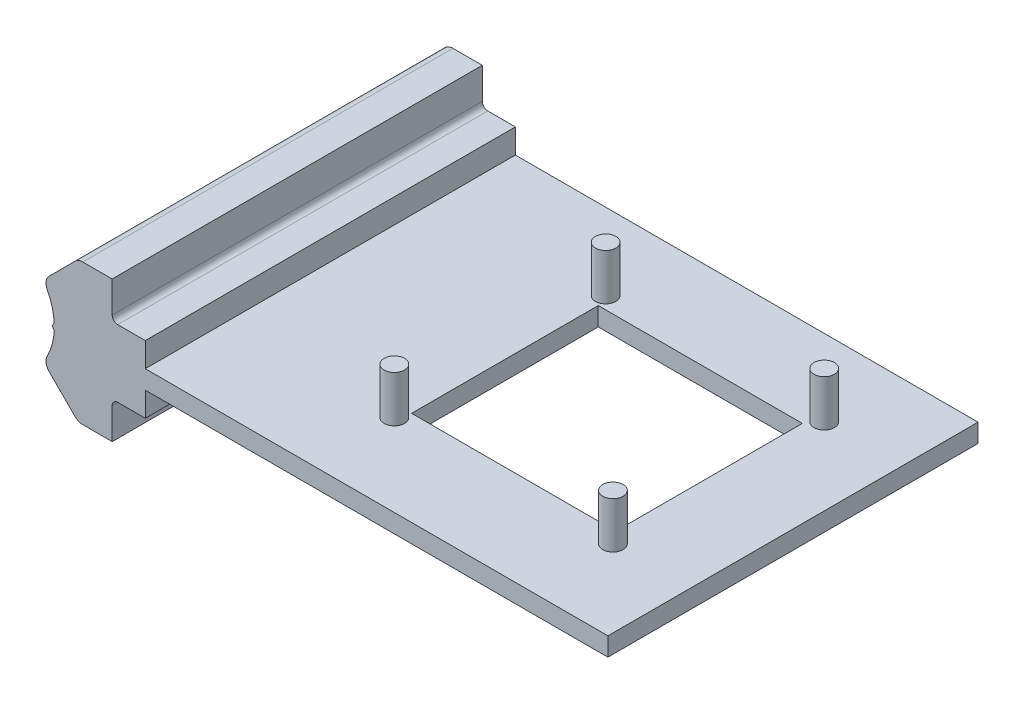
ISO-10303-21;
HEADER;
FILE_DESCRIPTION(('STEP AP214'),'2;1');
FILE_NAME('part.step','',(''),(''),'','','');
FILE_SCHEMA(('AUTOMOTIVE_DESIGN { 1 0 10303 214 1 1 1 1 }'));
ENDSEC;
DATA;
#1=APPLICATION_CONTEXT('core data for automotive mechanical design processes');
#2=APPLICATION_PROTOCOL_DEFINITION('international standard','automotive_design',2000,#1);
#3=PRODUCT_CONTEXT('',#1,'mechanical');
#4=PRODUCT('Part','Part','',(#3));
#5=PRODUCT_RELATED_PRODUCT_CATEGORY('part','',(#4));
#6=PRODUCT_DEFINITION_FORMATION('','',#4);
#7=PRODUCT_DEFINITION_CONTEXT('part definition',#1,'design');
#8=PRODUCT_DEFINITION('design','',#6,#7);
#9=PRODUCT_DEFINITION_SHAPE('','',#8);
#10=(LENGTH_UNIT() NAMED_UNIT(*) SI_UNIT(.MILLI.,.METRE.));
#11=(NAMED_UNIT(*) PLANE_ANGLE_UNIT() SI_UNIT($,.RADIAN.));
#12=(NAMED_UNIT(*) SI_UNIT($,.STERADIAN.) SOLID_ANGLE_UNIT());
#13=UNCERTAINTY_MEASURE_WITH_UNIT(LENGTH_MEASURE(1.E-05),#10,'distance_accuracy_value','');
#14=(GEOMETRIC_REPRESENTATION_CONTEXT(3) GLOBAL_UNCERTAINTY_ASSIGNED_CONTEXT((#13)) GLOBAL_UNIT_ASSIGNED_CONTEXT((#10,
#11,#12)) REPRESENTATION_CONTEXT('',''));
#15=CARTESIAN_POINT('',(0.,0.,0.));
#16=DIRECTION('',(0.,0.,1.));
#17=DIRECTION('',(1.,0.,0.));
#18=AXIS2_PLACEMENT_3D('',#15,#16,#17);
#19=CARTESIAN_POINT('',(42.5097065168337,15.9553416596242,387.558905075487));
#20=DIRECTION('',(0.,1.,0.));
#21=DIRECTION('',(0.,0.,1.));
#22=AXIS2_PLACEMENT_3D('',#19,#20,#21);
#23=PLANE('',#22);
#24=DIRECTION('',(0.,0.,1.));
#25=VECTOR('',#24,1.);
#26=CARTESIAN_POINT('',(66.0868749176624,15.9553416596242,399.7634213984));
#27=LINE('',#26,#25);
#28=CARTESIAN_POINT('',(66.0868749176624,15.9553416596242,399.7634213984));
#29=VERTEX_POINT('',#28);
#30=CARTESIAN_POINT('',(66.0868749176624,15.9553416596242,425.3814213984));
#31=VERTEX_POINT('',#30);
#32=EDGE_CURVE('E58',#29,#31,#27,.T.);
#33=ORIENTED_EDGE('',*,*,#32,.F.);
#34=DIRECTION('',(-1.,0.,0.));
#35=VECTOR('',#34,1.);
#36=CARTESIAN_POINT('',(66.0868749176624,15.9553416596242,399.7634213984));
#37=LINE('',#36,#35);
#38=CARTESIAN_POINT('',(94.1018749176624,15.9553416596242,399.7634213984));
#39=VERTEX_POINT('',#38);
#40=EDGE_CURVE('E241',#39,#29,#37,.T.);
#41=ORIENTED_EDGE('',*,*,#40,.F.);
#42=DIRECTION('',(0.,0.,-1.));
#43=VECTOR('',#42,1.);
#44=CARTESIAN_POINT('',(94.1018749176624,15.9553416596242,399.7634213984));
#45=LINE('',#44,#43);
#46=CARTESIAN_POINT('',(94.1018749176624,15.9553416596242,425.3814213984));
#47=VERTEX_POINT('',#46);
#48=EDGE_CURVE('E224',#47,#39,#45,.T.);
#49=ORIENTED_EDGE('',*,*,#48,.F.);
#50=DIRECTION('',(1.,0.,0.));
#51=VECTOR('',#50,1.);
#52=CARTESIAN_POINT('',(66.0868749176624,15.9553416596242,425.3814213984));
#53=LINE('',#52,#51);
#54=EDGE_CURVE('E234',#31,#47,#53,.T.);
#55=ORIENTED_EDGE('',*,*,#54,.F.);
#56=EDGE_LOOP('',(#33,#41,#49,#55));
#57=FACE_BOUND('',#56,.T.);
#58=CARTESIAN_POINT('',(65.4118749176624,15.9553416596242,427.0724213984));
#59=DIRECTION('',(0.,1.,0.));
#60=DIRECTION('',(0.,0.,1.));
#61=AXIS2_PLACEMENT_3D('',#58,#59,#60);
#62=CIRCLE('',#61,1.39699999999996);
#63=CARTESIAN_POINT('',(65.4118749176624,15.9553416596242,428.4694213984));
#64=VERTEX_POINT('',#63);
#65=EDGE_CURVE('E256',#64,#64,#62,.T.);
#66=ORIENTED_EDGE('',*,*,#65,.F.);
#67=EDGE_LOOP('',(#66));
#68=FACE_BOUND('',#67,.T.);
#69=CARTESIAN_POINT('',(95.4118749176624,15.9553416596242,427.0724213984));
#70=DIRECTION('',(0.,1.,0.));
#71=DIRECTION('',(0.,0.,1.));
#72=AXIS2_PLACEMENT_3D('',#69,#70,#71);
#73=CIRCLE('',#72,1.39699999999996);
#74=CARTESIAN_POINT('',(95.4118749176624,15.9553416596242,428.4694213984));
#75=VERTEX_POINT('',#74);
#76=EDGE_CURVE('E264',#75,#75,#73,.T.);
#77=ORIENTED_EDGE('',*,*,#76,.F.);
#78=EDGE_LOOP('',(#77));
#79=FACE_BOUND('',#78,.T.);
#80=CARTESIAN_POINT('',(95.4118749176624,15.9553416596242,398.0724213984));
#81=DIRECTION('',(0.,1.,0.));
#82=DIRECTION('',(0.,0.,1.));
#83=AXIS2_PLACEMENT_3D('',#80,#81,#82);
#84=CIRCLE('',#83,1.39699999999996);
#85=CARTESIAN_POINT('',(95.4118749176624,15.9553416596242,399.4694213984));
#86=VERTEX_POINT('',#85);
#87=EDGE_CURVE('E272',#86,#86,#84,.T.);
#88=ORIENTED_EDGE('',*,*,#87,.F.);
#89=EDGE_LOOP('',(#88));
#90=FACE_BOUND('',#89,.T.);
#91=CARTESIAN_POINT('',(65.4118749176624,15.9553416596242,398.0724213984));
#92=DIRECTION('',(0.,1.,0.));
#93=DIRECTION('',(0.,0.,1.));
#94=AXIS2_PLACEMENT_3D('',#91,#92,#93);
#95=CIRCLE('',#94,1.39699999999996);
#96=CARTESIAN_POINT('',(65.4118749176624,15.9553416596242,399.4694213984));
#97=VERTEX_POINT('',#96);
#98=EDGE_CURVE('E276',#97,#97,#95,.T.);
#99=ORIENTED_EDGE('',*,*,#98,.F.);
#100=EDGE_LOOP('',(#99));
#101=FACE_BOUND('',#100,.T.);
#102=DIRECTION('',(-1.,0.,0.));
#103=VECTOR('',#102,1.);
#104=CARTESIAN_POINT('',(42.5097065168337,15.9553416596242,438.358905075487));
#105=LINE('',#104,#103);
#106=CARTESIAN_POINT('',(106.009706516834,15.9553416596242,438.358905075487));
#107=VERTEX_POINT('',#106);
#108=CARTESIAN_POINT('',(42.5097065168337,15.9553416596242,438.358905075487));
#109=VERTEX_POINT('',#108);
#110=EDGE_CURVE('E284',#107,#109,#105,.T.);
#111=ORIENTED_EDGE('',*,*,#110,.F.);
#112=DIRECTION('',(0.,0.,1.));
#113=VECTOR('',#112,1.);
#114=CARTESIAN_POINT('',(106.009706516834,15.9553416596242,387.558905075487));
#115=LINE('',#114,#113);
#116=CARTESIAN_POINT('',(106.009706516834,15.9553416596242,387.558905075487));
#117=VERTEX_POINT('',#116);
#118=EDGE_CURVE('E472',#117,#107,#115,.T.);
#119=ORIENTED_EDGE('',*,*,#118,.F.);
#120=DIRECTION('',(-1.,0.,0.));
#121=VECTOR('',#120,1.);
#122=CARTESIAN_POINT('',(42.5097065168337,15.9553416596242,387.558905075487));
#123=LINE('',#122,#121);
#124=CARTESIAN_POINT('',(42.5097065168337,15.9553416596242,387.558905075487));
#125=VERTEX_POINT('',#124);
#126=EDGE_CURVE('E288',#117,#125,#123,.T.);
#127=ORIENTED_EDGE('',*,*,#126,.T.);
#128=DIRECTION('',(0.,0.,1.));
#129=VECTOR('',#128,1.);
#130=CARTESIAN_POINT('',(42.5097065168337,15.9553416596242,387.558905075487));
#131=LINE('',#130,#129);
#132=EDGE_CURVE('E381',#125,#109,#131,.T.);
#133=ORIENTED_EDGE('',*,*,#132,.T.);
#134=EDGE_LOOP('',(#111,#119,#127,#133));
#135=FACE_BOUND('',#134,.T.);
#136=ADVANCED_FACE('F43',(#57,#68,#79,#90,#101,#135),#23,.T.);
#137=CARTESIAN_POINT('',(106.009706516834,15.9553416596242,387.558905075487));
#138=DIRECTION('',(1.,0.,0.));
#139=DIRECTION('',(0.,0.,-1.));
#140=AXIS2_PLACEMENT_3D('',#137,#138,#139);
#141=PLANE('',#140);
#142=DIRECTION('',(0.,1.,0.));
#143=VECTOR('',#142,1.);
#144=CARTESIAN_POINT('',(106.009706516834,15.9553416596242,438.358905075487));
#145=LINE('',#144,#143);
#146=CARTESIAN_POINT('',(106.009706516834,13.4153416596242,438.358905075487));
#147=VERTEX_POINT('',#146);
#148=EDGE_CURVE('E293',#147,#107,#145,.T.);
#149=ORIENTED_EDGE('',*,*,#148,.F.);
#150=DIRECTION('',(0.,0.,1.));
#151=VECTOR('',#150,1.);
#152=CARTESIAN_POINT('',(106.009706516834,13.4153416596242,387.558905075487));
#153=LINE('',#152,#151);
#154=CARTESIAN_POINT('',(106.009706516834,13.4153416596242,387.558905075487));
#155=VERTEX_POINT('',#154);
#156=EDGE_CURVE('E476',#155,#147,#153,.T.);
#157=ORIENTED_EDGE('',*,*,#156,.F.);
#158=DIRECTION('',(0.,1.,0.));
#159=VECTOR('',#158,1.);
#160=CARTESIAN_POINT('',(106.009706516834,15.9553416596242,387.558905075487));
#161=LINE('',#160,#159);
#162=EDGE_CURVE('E377',#155,#117,#161,.T.);
#163=ORIENTED_EDGE('',*,*,#162,.T.);
#164=ORIENTED_EDGE('',*,*,#118,.T.);
#165=EDGE_LOOP('',(#149,#157,#163,#164));
#166=FACE_BOUND('',#165,.T.);
#167=ADVANCED_FACE('F569',(#166),#141,.T.);
#168=CARTESIAN_POINT('',(106.009706516834,13.4153416596242,387.558905075487));
#169=DIRECTION('',(0.,-1.,0.));
#170=DIRECTION('',(0.,0.,-1.));
#171=AXIS2_PLACEMENT_3D('',#168,#169,#170);
#172=PLANE('',#171);
#173=DIRECTION('',(0.,0.,-1.));
#174=VECTOR('',#173,1.);
#175=CARTESIAN_POINT('',(66.0868749176624,13.4153416596242,387.558905075487));
#176=LINE('',#175,#174);
#177=CARTESIAN_POINT('',(66.0868749176624,13.4153416596242,425.3814213984));
#178=VERTEX_POINT('',#177);
#179=CARTESIAN_POINT('',(66.0868749176624,13.4153416596242,399.7634213984));
#180=VERTEX_POINT('',#179);
#181=EDGE_CURVE('E11',#178,#180,#176,.T.);
#182=ORIENTED_EDGE('',*,*,#181,.F.);
#183=DIRECTION('',(-1.,0.,0.));
#184=VECTOR('',#183,1.);
#185=CARTESIAN_POINT('',(106.009706516834,13.4153416596242,425.3814213984));
#186=LINE('',#185,#184);
#187=CARTESIAN_POINT('',(94.1018749176624,13.4153416596242,425.3814213984));
#188=VERTEX_POINT('',#187);
#189=EDGE_CURVE('E475',#188,#178,#186,.T.);
#190=ORIENTED_EDGE('',*,*,#189,.F.);
#191=DIRECTION('',(0.,0.,1.));
#192=VECTOR('',#191,1.);
#193=CARTESIAN_POINT('',(94.1018749176624,13.4153416596242,387.558905075487));
#194=LINE('',#193,#192);
#195=CARTESIAN_POINT('',(94.1018749176624,13.4153416596242,399.7634213984));
#196=VERTEX_POINT('',#195);
#197=EDGE_CURVE('E227',#196,#188,#194,.T.);
#198=ORIENTED_EDGE('',*,*,#197,.F.);
#199=DIRECTION('',(1.,0.,0.));
#200=VECTOR('',#199,1.);
#201=CARTESIAN_POINT('',(106.009706516834,13.4153416596242,399.7634213984));
#202=LINE('',#201,#200);
#203=EDGE_CURVE('E51',#180,#196,#202,.T.);
#204=ORIENTED_EDGE('',*,*,#203,.F.);
#205=EDGE_LOOP('',(#182,#190,#198,#204));
#206=FACE_BOUND('',#205,.T.);
#207=DIRECTION('',(1.,0.,0.));
#208=VECTOR('',#207,1.);
#209=CARTESIAN_POINT('',(106.009706516834,13.4153416596242,438.358905075487));
#210=LINE('',#209,#208);
#211=CARTESIAN_POINT('',(42.5097065168337,13.4153416596242,438.358905075487));
#212=VERTEX_POINT('',#211);
#213=EDGE_CURVE('E465',#212,#147,#210,.T.);
#214=ORIENTED_EDGE('',*,*,#213,.F.);
#215=DIRECTION('',(0.,0.,1.));
#216=VECTOR('',#215,1.);
#217=CARTESIAN_POINT('',(42.5097065168337,13.4153416596242,387.558905075487));
#218=LINE('',#217,#216);
#219=CARTESIAN_POINT('',(42.5097065168337,13.4153416596242,387.558905075487));
#220=VERTEX_POINT('',#219);
#221=EDGE_CURVE('E479',#220,#212,#218,.T.);
#222=ORIENTED_EDGE('',*,*,#221,.F.);
#223=DIRECTION('',(1.,0.,0.));
#224=VECTOR('',#223,1.);
#225=CARTESIAN_POINT('',(106.009706516834,13.4153416596242,387.558905075487));
#226=LINE('',#225,#224);
#227=EDGE_CURVE('E373',#220,#155,#226,.T.);
#228=ORIENTED_EDGE('',*,*,#227,.T.);
#229=ORIENTED_EDGE('',*,*,#156,.T.);
#230=EDGE_LOOP('',(#214,#222,#228,#229));
#231=FACE_BOUND('',#230,.T.);
#232=ADVANCED_FACE('F551',(#206,#231),#172,.T.);
#233=CARTESIAN_POINT('',(42.5097065168337,13.4153416596242,387.558905075487));
#234=DIRECTION('',(1.,0.,0.));
#235=DIRECTION('',(0.,1.,0.));
#236=AXIS2_PLACEMENT_3D('',#233,#234,#235);
#237=PLANE('',#236);
#238=DIRECTION('',(0.,1.,0.));
#239=VECTOR('',#238,1.);
#240=CARTESIAN_POINT('',(42.5097065168337,13.4153416596242,438.358905075487));
#241=LINE('',#240,#239);
#242=CARTESIAN_POINT('',(42.5097065168337,10.0663416596244,438.358905075487));
#243=VERTEX_POINT('',#242);
#244=EDGE_CURVE('E461',#243,#212,#241,.T.);
#245=ORIENTED_EDGE('',*,*,#244,.F.);
#246=DIRECTION('',(0.,0.,1.));
#247=VECTOR('',#246,1.);
#248=CARTESIAN_POINT('',(42.5097065168337,10.0663416596244,387.558905075487));
#249=LINE('',#248,#247);
#250=CARTESIAN_POINT('',(42.5097065168337,10.0663416596244,387.558905075487));
#251=VERTEX_POINT('',#250);
#252=EDGE_CURVE('E482',#251,#243,#249,.T.);
#253=ORIENTED_EDGE('',*,*,#252,.F.);
#254=DIRECTION('',(0.,1.,0.));
#255=VECTOR('',#254,1.);
#256=CARTESIAN_POINT('',(42.5097065168337,13.4153416596242,387.558905075487));
#257=LINE('',#256,#255);
#258=EDGE_CURVE('E369',#251,#220,#257,.T.);
#259=ORIENTED_EDGE('',*,*,#258,.T.);
#260=ORIENTED_EDGE('',*,*,#221,.T.);
#261=EDGE_LOOP('',(#245,#253,#259,#260));
#262=FACE_BOUND('',#261,.T.);
#263=ADVANCED_FACE('F578',(#262),#237,.T.);
#264=CARTESIAN_POINT('',(38.7252065168337,10.0663416596244,387.558905075487));
#265=DIRECTION('',(0.,-1.,0.));
#266=DIRECTION('',(1.,0.,0.));
#267=AXIS2_PLACEMENT_3D('',#264,#265,#266);
#268=PLANE('',#267);
#269=DIRECTION('',(1.,0.,0.));
#270=VECTOR('',#269,1.);
#271=CARTESIAN_POINT('',(38.7252065168337,10.0663416596244,438.358905075487));
#272=LINE('',#271,#270);
#273=CARTESIAN_POINT('',(38.7252065168337,10.0663416596244,438.358905075487));
#274=VERTEX_POINT('',#273);
#275=EDGE_CURVE('E457',#274,#243,#272,.T.);
#276=ORIENTED_EDGE('',*,*,#275,.F.);
#277=DIRECTION('',(0.,0.,1.));
#278=VECTOR('',#277,1.);
#279=CARTESIAN_POINT('',(38.7252065168337,10.0663416596244,387.558905075487));
#280=LINE('',#279,#278);
#281=CARTESIAN_POINT('',(38.7252065168337,10.0663416596244,387.558905075487));
#282=VERTEX_POINT('',#281);
#283=EDGE_CURVE('E485',#282,#274,#280,.T.);
#284=ORIENTED_EDGE('',*,*,#283,.F.);
#285=DIRECTION('',(1.,0.,0.));
#286=VECTOR('',#285,1.);
#287=CARTESIAN_POINT('',(38.7252065168337,10.0663416596244,387.558905075487));
#288=LINE('',#287,#286);
#289=EDGE_CURVE('E365',#282,#251,#288,.T.);
#290=ORIENTED_EDGE('',*,*,#289,.T.);
#291=ORIENTED_EDGE('',*,*,#252,.T.);
#292=EDGE_LOOP('',(#276,#284,#290,#291));
#293=FACE_BOUND('',#292,.T.);
#294=ADVANCED_FACE('F587',(#293),#268,.T.);
#295=CARTESIAN_POINT('',(38.7252065168337,9.30834165962445,387.558905075487));
#296=DIRECTION('',(0.,0.,1.));
#297=DIRECTION('',(1.,0.,0.));
#298=AXIS2_PLACEMENT_3D('',#295,#296,#297);
#299=CYLINDRICAL_SURFACE('',#298,0.758000000000001);
#300=CARTESIAN_POINT('',(38.7252065168337,9.30834165962445,438.358905075487));
#301=DIRECTION('',(0.,0.,-1.));
#302=DIRECTION('',(1.,0.,0.));
#303=AXIS2_PLACEMENT_3D('',#300,#301,#302);
#304=CIRCLE('',#303,0.758000000000001);
#305=CARTESIAN_POINT('',(37.9672065168337,9.30834165962445,438.358905075487));
#306=VERTEX_POINT('',#305);
#307=EDGE_CURVE('E453',#306,#274,#304,.T.);
#308=ORIENTED_EDGE('',*,*,#307,.F.);
#309=DIRECTION('',(0.,0.,1.));
#310=VECTOR('',#309,1.);
#311=CARTESIAN_POINT('',(37.9672065168337,9.30834165962445,387.558905075487));
#312=LINE('',#311,#310);
#313=CARTESIAN_POINT('',(37.9672065168337,9.30834165962445,387.558905075487));
#314=VERTEX_POINT('',#313);
#315=EDGE_CURVE('E488',#314,#306,#312,.T.);
#316=ORIENTED_EDGE('',*,*,#315,.F.);
#317=CARTESIAN_POINT('',(38.7252065168337,9.30834165962445,387.558905075487));
#318=DIRECTION('',(0.,0.,-1.));
#319=DIRECTION('',(1.,0.,0.));
#320=AXIS2_PLACEMENT_3D('',#317,#318,#319);
#321=CIRCLE('',#320,0.758000000000001);
#322=EDGE_CURVE('E361',#314,#282,#321,.T.);
#323=ORIENTED_EDGE('',*,*,#322,.T.);
#324=ORIENTED_EDGE('',*,*,#283,.T.);
#325=EDGE_LOOP('',(#308,#316,#323,#324));
#326=FACE_BOUND('',#325,.T.);
#327=ADVANCED_FACE('F591',(#326),#299,.F.);
#328=CARTESIAN_POINT('',(37.9672065168337,5.01634165962445,387.558905075487));
#329=DIRECTION('',(1.,0.,0.));
#330=DIRECTION('',(0.,0.,-1.));
#331=AXIS2_PLACEMENT_3D('',#328,#329,#330);
#332=PLANE('',#331);
#333=DIRECTION('',(0.,1.,0.));
#334=VECTOR('',#333,1.);
#335=CARTESIAN_POINT('',(37.9672065168337,5.01634165962445,438.358905075487));
#336=LINE('',#335,#334);
#337=CARTESIAN_POINT('',(37.9672065168337,5.01634165962445,438.358905075487));
#338=VERTEX_POINT('',#337);
#339=EDGE_CURVE('E449',#338,#306,#336,.T.);
#340=ORIENTED_EDGE('',*,*,#339,.F.);
#341=DIRECTION('',(0.,0.,1.));
#342=VECTOR('',#341,1.);
#343=CARTESIAN_POINT('',(37.9672065168337,5.01634165962445,387.558905075487));
#344=LINE('',#343,#342);
#345=CARTESIAN_POINT('',(37.9672065168337,5.01634165962445,387.558905075487));
#346=VERTEX_POINT('',#345);
#347=EDGE_CURVE('E491',#346,#338,#344,.T.);
#348=ORIENTED_EDGE('',*,*,#347,.F.);
#349=DIRECTION('',(0.,1.,0.));
#350=VECTOR('',#349,1.);
#351=CARTESIAN_POINT('',(37.9672065168337,5.01634165962445,387.558905075487));
#352=LINE('',#351,#350);
#353=EDGE_CURVE('E357',#346,#314,#352,.T.);
#354=ORIENTED_EDGE('',*,*,#353,.T.);
#355=ORIENTED_EDGE('',*,*,#315,.T.);
#356=EDGE_LOOP('',(#340,#348,#354,#355));
#357=FACE_BOUND('',#356,.T.);
#358=ADVANCED_FACE('F595',(#357),#332,.T.);
#359=CARTESIAN_POINT('',(33.928999081907,5.01634165962445,387.558905075487));
#360=DIRECTION('',(0.,-1.,0.));
#361=DIRECTION('',(1.,0.,0.));
#362=AXIS2_PLACEMENT_3D('',#359,#360,#361);
#363=PLANE('',#362);
#364=DIRECTION('',(1.,0.,0.));
#365=VECTOR('',#364,1.);
#366=CARTESIAN_POINT('',(33.928999081907,5.01634165962445,438.358905075487));
#367=LINE('',#366,#365);
#368=CARTESIAN_POINT('',(33.928999081907,5.01634165962445,438.358905075487));
#369=VERTEX_POINT('',#368);
#370=EDGE_CURVE('E445',#369,#338,#367,.T.);
#371=ORIENTED_EDGE('',*,*,#370,.F.);
#372=DIRECTION('',(0.,0.,1.));
#373=VECTOR('',#372,1.);
#374=CARTESIAN_POINT('',(33.928999081907,5.01634165962445,387.558905075487));
#375=LINE('',#374,#373);
#376=CARTESIAN_POINT('',(33.928999081907,5.01634165962445,387.558905075487));
#377=VERTEX_POINT('',#376);
#378=EDGE_CURVE('E494',#377,#369,#375,.T.);
#379=ORIENTED_EDGE('',*,*,#378,.F.);
#380=DIRECTION('',(1.,0.,0.));
#381=VECTOR('',#380,1.);
#382=CARTESIAN_POINT('',(33.928999081907,5.01634165962445,387.558905075487));
#383=LINE('',#382,#381);
#384=EDGE_CURVE('E353',#377,#346,#383,.T.);
#385=ORIENTED_EDGE('',*,*,#384,.T.);
#386=ORIENTED_EDGE('',*,*,#347,.T.);
#387=EDGE_LOOP('',(#371,#379,#385,#386));
#388=FACE_BOUND('',#387,.T.);
#389=ADVANCED_FACE('F599',(#388),#363,.T.);
#390=CARTESIAN_POINT('',(33.928999081907,6.52034165962445,387.558905075487));
#391=DIRECTION('',(0.,0.,1.));
#392=DIRECTION('',(1.,0.,0.));
#393=AXIS2_PLACEMENT_3D('',#390,#391,#392);
#394=CYLINDRICAL_SURFACE('',#393,1.504);
#395=CARTESIAN_POINT('',(33.928999081907,6.52034165962445,438.358905075487));
#396=DIRECTION('',(0.,0.,1.));
#397=DIRECTION('',(1.,0.,0.));
#398=AXIS2_PLACEMENT_3D('',#395,#396,#397);
#399=CIRCLE('',#398,1.504);
#400=CARTESIAN_POINT('',(32.8655104830024,5.45685306071988,438.358905075487));
#401=VERTEX_POINT('',#400);
#402=EDGE_CURVE('E441',#401,#369,#399,.T.);
#403=ORIENTED_EDGE('',*,*,#402,.F.);
#404=DIRECTION('',(0.,0.,1.));
#405=VECTOR('',#404,1.);
#406=CARTESIAN_POINT('',(32.8655104830024,5.45685306071988,387.558905075487));
#407=LINE('',#406,#405);
#408=CARTESIAN_POINT('',(32.8655104830024,5.45685306071988,387.558905075487));
#409=VERTEX_POINT('',#408);
#410=EDGE_CURVE('E497',#409,#401,#407,.T.);
#411=ORIENTED_EDGE('',*,*,#410,.F.);
#412=CARTESIAN_POINT('',(33.928999081907,6.52034165962445,387.558905075487));
#413=DIRECTION('',(0.,0.,1.));
#414=DIRECTION('',(1.,0.,0.));
#415=AXIS2_PLACEMENT_3D('',#412,#413,#414);
#416=CIRCLE('',#415,1.504);
#417=EDGE_CURVE('E349',#409,#377,#416,.T.);
#418=ORIENTED_EDGE('',*,*,#417,.T.);
#419=ORIENTED_EDGE('',*,*,#378,.T.);
#420=EDGE_LOOP('',(#403,#411,#418,#419));
#421=FACE_BOUND('',#420,.T.);
#422=ADVANCED_FACE('F603',(#421),#394,.T.);
#423=CARTESIAN_POINT('',(29.3225599629942,8.99980358072807,387.558905075487));
#424=DIRECTION('',(-0.707106781186548,-0.707106781186547,0.));
#425=DIRECTION('',(0.707106781186547,-0.707106781186548,0.));
#426=AXIS2_PLACEMENT_3D('',#423,#424,#425);
#427=PLANE('',#426);
#428=DIRECTION('',(0.707106781186547,-0.707106781186548,0.));
#429=VECTOR('',#428,1.);
#430=CARTESIAN_POINT('',(29.3225599629942,8.99980358072807,438.358905075487));
#431=LINE('',#430,#429);
#432=CARTESIAN_POINT('',(29.3225599629942,8.99980358072808,438.358905075487));
#433=VERTEX_POINT('',#432);
#434=EDGE_CURVE('E437',#433,#401,#431,.T.);
#435=ORIENTED_EDGE('',*,*,#434,.F.);
#436=DIRECTION('',(0.,0.,1.));
#437=VECTOR('',#436,1.);
#438=CARTESIAN_POINT('',(29.3225599629942,8.99980358072808,387.558905075487));
#439=LINE('',#438,#437);
#440=CARTESIAN_POINT('',(29.3225599629942,8.99980358072808,387.558905075487));
#441=VERTEX_POINT('',#440);
#442=EDGE_CURVE('E500',#441,#433,#439,.T.);
#443=ORIENTED_EDGE('',*,*,#442,.F.);
#444=DIRECTION('',(0.707106781186547,-0.707106781186548,0.));
#445=VECTOR('',#444,1.);
#446=CARTESIAN_POINT('',(29.3225599629942,8.99980358072807,387.558905075487));
#447=LINE('',#446,#445);
#448=EDGE_CURVE('E345',#441,#409,#447,.T.);
#449=ORIENTED_EDGE('',*,*,#448,.T.);
#450=ORIENTED_EDGE('',*,*,#410,.T.);
#451=EDGE_LOOP('',(#435,#443,#449,#450));
#452=FACE_BOUND('',#451,.T.);
#453=ADVANCED_FACE('F607',(#452),#427,.T.);
#454=CARTESIAN_POINT('',(30.3860485618988,10.0632921796326,387.558905075487));
#455=DIRECTION('',(0.,0.,1.));
#456=DIRECTION('',(1.,0.,0.));
#457=AXIS2_PLACEMENT_3D('',#454,#455,#456);
#458=CYLINDRICAL_SURFACE('',#457,1.504);
#459=CARTESIAN_POINT('',(30.3860485618988,10.0632921796326,438.358905075487));
#460=DIRECTION('',(0.,0.,1.));
#461=DIRECTION('',(1.,0.,0.));
#462=AXIS2_PLACEMENT_3D('',#459,#460,#461);
#463=CIRCLE('',#462,1.504);
#464=CARTESIAN_POINT('',(29.0565883256036,10.7665357221625,438.358905075487));
#465=VERTEX_POINT('',#464);
#466=EDGE_CURVE('E433',#465,#433,#463,.T.);
#467=ORIENTED_EDGE('',*,*,#466,.F.);
#468=DIRECTION('',(0.,0.,1.));
#469=VECTOR('',#468,1.);
#470=CARTESIAN_POINT('',(29.0565883256036,10.7665357221625,387.558905075487));
#471=LINE('',#470,#469);
#472=CARTESIAN_POINT('',(29.0565883256036,10.7665357221625,387.558905075487));
#473=VERTEX_POINT('',#472);
#474=EDGE_CURVE('E503',#473,#465,#471,.T.);
#475=ORIENTED_EDGE('',*,*,#474,.F.);
#476=CARTESIAN_POINT('',(30.3860485618988,10.0632921796326,387.558905075487));
#477=DIRECTION('',(0.,0.,1.));
#478=DIRECTION('',(1.,0.,0.));
#479=AXIS2_PLACEMENT_3D('',#476,#477,#478);
#480=CIRCLE('',#479,1.504);
#481=EDGE_CURVE('E341',#473,#441,#480,.T.);
#482=ORIENTED_EDGE('',*,*,#481,.T.);
#483=ORIENTED_EDGE('',*,*,#442,.T.);
#484=EDGE_LOOP('',(#467,#475,#482,#483));
#485=FACE_BOUND('',#484,.T.);
#486=ADVANCED_FACE('F611',(#485),#458,.T.);
#487=CARTESIAN_POINT('',(21.6482065168337,14.6853416596245,387.558905075487));
#488=DIRECTION('',(0.,0.,1.));
#489=DIRECTION('',(1.,0.,0.));
#490=AXIS2_PLACEMENT_3D('',#487,#488,#489);
#491=CYLINDRICAL_SURFACE('',#490,8.381);
#492=CARTESIAN_POINT('',(21.6482065168337,14.6853416596245,438.358905075487));
#493=DIRECTION('',(0.,0.,-1.));
#494=DIRECTION('',(1.,0.,0.));
#495=AXIS2_PLACEMENT_3D('',#492,#493,#494);
#496=CIRCLE('',#495,8.381);
#497=CARTESIAN_POINT('',(30.0174744135237,14.2420405504055,438.358905075487));
#498=VERTEX_POINT('',#497);
#499=EDGE_CURVE('E429',#498,#465,#496,.T.);
#500=ORIENTED_EDGE('',*,*,#499,.F.);
#501=DIRECTION('',(0.,0.,1.));
#502=VECTOR('',#501,1.);
#503=CARTESIAN_POINT('',(30.0174744135237,14.2420405504055,387.558905075487));
#504=LINE('',#503,#502);
#505=CARTESIAN_POINT('',(30.0174744135237,14.2420405504055,387.558905075487));
#506=VERTEX_POINT('',#505);
#507=EDGE_CURVE('E506',#506,#498,#504,.T.);
#508=ORIENTED_EDGE('',*,*,#507,.F.);
#509=CARTESIAN_POINT('',(21.6482065168337,14.6853416596245,387.558905075487));
#510=DIRECTION('',(0.,0.,-1.));
#511=DIRECTION('',(1.,0.,0.));
#512=AXIS2_PLACEMENT_3D('',#509,#510,#511);
#513=CIRCLE('',#512,8.381);
#514=EDGE_CURVE('E337',#506,#473,#513,.T.);
#515=ORIENTED_EDGE('',*,*,#514,.T.);
#516=ORIENTED_EDGE('',*,*,#474,.T.);
#517=EDGE_LOOP('',(#500,#508,#515,#516));
#518=FACE_BOUND('',#517,.T.);
#519=ADVANCED_FACE('F615',(#518),#491,.F.);
#520=CARTESIAN_POINT('',(29.7070716351518,14.6853416596245,387.558905075487));
#521=DIRECTION('',(-0.819152044288992,-0.573576436351045,0.));
#522=DIRECTION('',(0.573576436351045,-0.819152044288992,0.));
#523=AXIS2_PLACEMENT_3D('',#520,#521,#522);
#524=PLANE('',#523);
#525=DIRECTION('',(0.573576436351045,-0.819152044288993,0.));
#526=VECTOR('',#525,1.);
#527=CARTESIAN_POINT('',(29.7070716351518,14.6853416596245,438.358905075487));
#528=LINE('',#527,#526);
#529=CARTESIAN_POINT('',(29.7070716351518,14.6853416596245,438.358905075487));
#530=VERTEX_POINT('',#529);
#531=EDGE_CURVE('E425',#530,#498,#528,.T.);
#532=ORIENTED_EDGE('',*,*,#531,.F.);
#533=DIRECTION('',(0.,0.,1.));
#534=VECTOR('',#533,1.);
#535=CARTESIAN_POINT('',(29.7070716351518,14.6853416596245,387.558905075487));
#536=LINE('',#535,#534);
#537=CARTESIAN_POINT('',(29.7070716351518,14.6853416596245,387.558905075487));
#538=VERTEX_POINT('',#537);
#539=EDGE_CURVE('E509',#538,#530,#536,.T.);
#540=ORIENTED_EDGE('',*,*,#539,.F.);
#541=DIRECTION('',(0.573576436351045,-0.819152044288993,0.));
#542=VECTOR('',#541,1.);
#543=CARTESIAN_POINT('',(29.7070716351518,14.6853416596245,387.558905075487));
#544=LINE('',#543,#542);
#545=EDGE_CURVE('E333',#538,#506,#544,.T.);
#546=ORIENTED_EDGE('',*,*,#545,.T.);
#547=ORIENTED_EDGE('',*,*,#507,.T.);
#548=EDGE_LOOP('',(#532,#540,#546,#547));
#549=FACE_BOUND('',#548,.T.);
#550=ADVANCED_FACE('F619',(#549),#524,.T.);
#551=CARTESIAN_POINT('',(30.0174744135237,15.1286427688434,387.558905075487));
#552=DIRECTION('',(-0.819152044288992,0.573576436351045,0.));
#553=DIRECTION('',(-0.573576436351045,-0.819152044288992,0.));
#554=AXIS2_PLACEMENT_3D('',#551,#552,#553);
#555=PLANE('',#554);
#556=DIRECTION('',(-0.573576436351045,-0.819152044288992,0.));
#557=VECTOR('',#556,1.);
#558=CARTESIAN_POINT('',(30.0174744135237,15.1286427688434,438.358905075487));
#559=LINE('',#558,#557);
#560=CARTESIAN_POINT('',(30.0174744135237,15.1286427688434,438.358905075487));
#561=VERTEX_POINT('',#560);
#562=EDGE_CURVE('E421',#561,#530,#559,.T.);
#563=ORIENTED_EDGE('',*,*,#562,.F.);
#564=DIRECTION('',(0.,0.,1.));
#565=VECTOR('',#564,1.);
#566=CARTESIAN_POINT('',(30.0174744135237,15.1286427688434,387.558905075487));
#567=LINE('',#566,#565);
#568=CARTESIAN_POINT('',(30.0174744135237,15.1286427688434,387.558905075487));
#569=VERTEX_POINT('',#568);
#570=EDGE_CURVE('E512',#569,#561,#567,.T.);
#571=ORIENTED_EDGE('',*,*,#570,.F.);
#572=DIRECTION('',(-0.573576436351045,-0.819152044288992,0.));
#573=VECTOR('',#572,1.);
#574=CARTESIAN_POINT('',(30.0174744135237,15.1286427688434,387.558905075487));
#575=LINE('',#574,#573);
#576=EDGE_CURVE('E329',#569,#538,#575,.T.);
#577=ORIENTED_EDGE('',*,*,#576,.T.);
#578=ORIENTED_EDGE('',*,*,#539,.T.);
#579=EDGE_LOOP('',(#563,#571,#577,#578));
#580=FACE_BOUND('',#579,.T.);
#581=ADVANCED_FACE('F623',(#580),#555,.T.);
#582=CARTESIAN_POINT('',(21.6482065168337,14.6853416596245,387.558905075487));
#583=DIRECTION('',(0.,0.,1.));
#584=DIRECTION('',(1.,0.,0.));
#585=AXIS2_PLACEMENT_3D('',#582,#583,#584);
#586=CYLINDRICAL_SURFACE('',#585,8.381);
#587=CARTESIAN_POINT('',(21.6482065168337,14.6853416596245,438.358905075487));
#588=DIRECTION('',(0.,0.,-1.));
#589=DIRECTION('',(1.,0.,0.));
#590=AXIS2_PLACEMENT_3D('',#587,#588,#589);
#591=CIRCLE('',#590,8.381);
#592=CARTESIAN_POINT('',(29.0565883256036,18.6041475970864,438.358905075487));
#593=VERTEX_POINT('',#592);
#594=EDGE_CURVE('E417',#593,#561,#591,.T.);
#595=ORIENTED_EDGE('',*,*,#594,.F.);
#596=DIRECTION('',(0.,0.,1.));
#597=VECTOR('',#596,1.);
#598=CARTESIAN_POINT('',(29.0565883256036,18.6041475970864,387.558905075487));
#599=LINE('',#598,#597);
#600=CARTESIAN_POINT('',(29.0565883256036,18.6041475970864,387.558905075487));
#601=VERTEX_POINT('',#600);
#602=EDGE_CURVE('E515',#601,#593,#599,.T.);
#603=ORIENTED_EDGE('',*,*,#602,.F.);
#604=CARTESIAN_POINT('',(21.6482065168337,14.6853416596245,387.558905075487));
#605=DIRECTION('',(0.,0.,-1.));
#606=DIRECTION('',(1.,0.,0.));
#607=AXIS2_PLACEMENT_3D('',#604,#605,#606);
#608=CIRCLE('',#607,8.381);
#609=EDGE_CURVE('E325',#601,#569,#608,.T.);
#610=ORIENTED_EDGE('',*,*,#609,.T.);
#611=ORIENTED_EDGE('',*,*,#570,.T.);
#612=EDGE_LOOP('',(#595,#603,#610,#611));
#613=FACE_BOUND('',#612,.T.);
#614=ADVANCED_FACE('F627',(#613),#586,.F.);
#615=CARTESIAN_POINT('',(30.3860485618988,19.3073911396163,387.558905075487));
#616=DIRECTION('',(0.,0.,1.));
#617=DIRECTION('',(1.,0.,0.));
#618=AXIS2_PLACEMENT_3D('',#615,#616,#617);
#619=CYLINDRICAL_SURFACE('',#618,1.504);
#620=CARTESIAN_POINT('',(30.3860485618988,19.3073911396163,438.358905075487));
#621=DIRECTION('',(0.,0.,1.));
#622=DIRECTION('',(1.,0.,0.));
#623=AXIS2_PLACEMENT_3D('',#620,#621,#622);
#624=CIRCLE('',#623,1.504);
#625=CARTESIAN_POINT('',(29.3225599629942,20.3708797385208,438.358905075487));
#626=VERTEX_POINT('',#625);
#627=EDGE_CURVE('E413',#626,#593,#624,.T.);
#628=ORIENTED_EDGE('',*,*,#627,.F.);
#629=DIRECTION('',(0.,0.,1.));
#630=VECTOR('',#629,1.);
#631=CARTESIAN_POINT('',(29.3225599629942,20.3708797385208,387.558905075487));
#632=LINE('',#631,#630);
#633=CARTESIAN_POINT('',(29.3225599629942,20.3708797385208,387.558905075487));
#634=VERTEX_POINT('',#633);
#635=EDGE_CURVE('E518',#634,#626,#632,.T.);
#636=ORIENTED_EDGE('',*,*,#635,.F.);
#637=CARTESIAN_POINT('',(30.3860485618988,19.3073911396163,387.558905075487));
#638=DIRECTION('',(0.,0.,1.));
#639=DIRECTION('',(1.,0.,0.));
#640=AXIS2_PLACEMENT_3D('',#637,#638,#639);
#641=CIRCLE('',#640,1.504);
#642=EDGE_CURVE('E321',#634,#601,#641,.T.);
#643=ORIENTED_EDGE('',*,*,#642,.T.);
#644=ORIENTED_EDGE('',*,*,#602,.T.);
#645=EDGE_LOOP('',(#628,#636,#643,#644));
#646=FACE_BOUND('',#645,.T.);
#647=ADVANCED_FACE('F631',(#646),#619,.T.);
#648=CARTESIAN_POINT('',(32.8655104830024,23.913830258529,387.558905075487));
#649=DIRECTION('',(-0.707106781186548,0.707106781186546,0.));
#650=DIRECTION('',(-0.707106781186547,-0.707106781186549,0.));
#651=AXIS2_PLACEMENT_3D('',#648,#649,#650);
#652=PLANE('',#651);
#653=DIRECTION('',(-0.707106781186546,-0.707106781186549,0.));
#654=VECTOR('',#653,1.);
#655=CARTESIAN_POINT('',(32.8655104830024,23.913830258529,438.358905075487));
#656=LINE('',#655,#654);
#657=CARTESIAN_POINT('',(32.8655104830024,23.913830258529,438.358905075487));
#658=VERTEX_POINT('',#657);
#659=EDGE_CURVE('E409',#658,#626,#656,.T.);
#660=ORIENTED_EDGE('',*,*,#659,.F.);
#661=DIRECTION('',(0.,0.,1.));
#662=VECTOR('',#661,1.);
#663=CARTESIAN_POINT('',(32.8655104830024,23.913830258529,387.558905075487));
#664=LINE('',#663,#662);
#665=CARTESIAN_POINT('',(32.8655104830024,23.913830258529,387.558905075487));
#666=VERTEX_POINT('',#665);
#667=EDGE_CURVE('E521',#666,#658,#664,.T.);
#668=ORIENTED_EDGE('',*,*,#667,.F.);
#669=DIRECTION('',(-0.707106781186546,-0.707106781186549,0.));
#670=VECTOR('',#669,1.);
#671=CARTESIAN_POINT('',(32.8655104830024,23.913830258529,387.558905075487));
#672=LINE('',#671,#670);
#673=EDGE_CURVE('E317',#666,#634,#672,.T.);
#674=ORIENTED_EDGE('',*,*,#673,.T.);
#675=ORIENTED_EDGE('',*,*,#635,.T.);
#676=EDGE_LOOP('',(#660,#668,#674,#675));
#677=FACE_BOUND('',#676,.T.);
#678=ADVANCED_FACE('F635',(#677),#652,.T.);
#679=CARTESIAN_POINT('',(33.928999081907,22.8503416596245,387.558905075487));
#680=DIRECTION('',(0.,0.,1.));
#681=DIRECTION('',(1.,0.,0.));
#682=AXIS2_PLACEMENT_3D('',#679,#680,#681);
#683=CYLINDRICAL_SURFACE('',#682,1.504);
#684=CARTESIAN_POINT('',(33.928999081907,22.8503416596245,438.358905075487));
#685=DIRECTION('',(0.,0.,1.));
#686=DIRECTION('',(1.,0.,0.));
#687=AXIS2_PLACEMENT_3D('',#684,#685,#686);
#688=CIRCLE('',#687,1.504);
#689=CARTESIAN_POINT('',(33.928999081907,24.3543416596245,438.358905075487));
#690=VERTEX_POINT('',#689);
#691=EDGE_CURVE('E405',#690,#658,#688,.T.);
#692=ORIENTED_EDGE('',*,*,#691,.F.);
#693=DIRECTION('',(0.,0.,1.));
#694=VECTOR('',#693,1.);
#695=CARTESIAN_POINT('',(33.928999081907,24.3543416596245,387.558905075487));
#696=LINE('',#695,#694);
#697=CARTESIAN_POINT('',(33.928999081907,24.3543416596245,387.558905075487));
#698=VERTEX_POINT('',#697);
#699=EDGE_CURVE('E524',#698,#690,#696,.T.);
#700=ORIENTED_EDGE('',*,*,#699,.F.);
#701=CARTESIAN_POINT('',(33.928999081907,22.8503416596245,387.558905075487));
#702=DIRECTION('',(0.,0.,1.));
#703=DIRECTION('',(1.,0.,0.));
#704=AXIS2_PLACEMENT_3D('',#701,#702,#703);
#705=CIRCLE('',#704,1.504);
#706=EDGE_CURVE('E313',#698,#666,#705,.T.);
#707=ORIENTED_EDGE('',*,*,#706,.T.);
#708=ORIENTED_EDGE('',*,*,#667,.T.);
#709=EDGE_LOOP('',(#692,#700,#707,#708));
#710=FACE_BOUND('',#709,.T.);
#711=ADVANCED_FACE('F639',(#710),#683,.T.);
#712=CARTESIAN_POINT('',(37.9672065168337,24.3543416596245,387.558905075487));
#713=DIRECTION('',(0.,1.,0.));
#714=DIRECTION('',(-1.,0.,0.));
#715=AXIS2_PLACEMENT_3D('',#712,#713,#714);
#716=PLANE('',#715);
#717=DIRECTION('',(-1.,0.,0.));
#718=VECTOR('',#717,1.);
#719=CARTESIAN_POINT('',(37.9672065168337,24.3543416596245,438.358905075487));
#720=LINE('',#719,#718);
#721=CARTESIAN_POINT('',(37.9672065168337,24.3543416596245,438.358905075487));
#722=VERTEX_POINT('',#721);
#723=EDGE_CURVE('E401',#722,#690,#720,.T.);
#724=ORIENTED_EDGE('',*,*,#723,.F.);
#725=DIRECTION('',(0.,0.,1.));
#726=VECTOR('',#725,1.);
#727=CARTESIAN_POINT('',(37.9672065168337,24.3543416596245,387.558905075487));
#728=LINE('',#727,#726);
#729=CARTESIAN_POINT('',(37.9672065168337,24.3543416596245,387.558905075487));
#730=VERTEX_POINT('',#729);
#731=EDGE_CURVE('E527',#730,#722,#728,.T.);
#732=ORIENTED_EDGE('',*,*,#731,.F.);
#733=DIRECTION('',(-1.,0.,0.));
#734=VECTOR('',#733,1.);
#735=CARTESIAN_POINT('',(37.9672065168337,24.3543416596245,387.558905075487));
#736=LINE('',#735,#734);
#737=EDGE_CURVE('E309',#730,#698,#736,.T.);
#738=ORIENTED_EDGE('',*,*,#737,.T.);
#739=ORIENTED_EDGE('',*,*,#699,.T.);
#740=EDGE_LOOP('',(#724,#732,#738,#739));
#741=FACE_BOUND('',#740,.T.);
#742=ADVANCED_FACE('F643',(#741),#716,.T.);
#743=CARTESIAN_POINT('',(37.9672065168337,20.0623416596245,387.558905075487));
#744=DIRECTION('',(1.,0.,0.));
#745=DIRECTION('',(0.,0.,-1.));
#746=AXIS2_PLACEMENT_3D('',#743,#744,#745);
#747=PLANE('',#746);
#748=DIRECTION('',(0.,1.,0.));
#749=VECTOR('',#748,1.);
#750=CARTESIAN_POINT('',(37.9672065168337,20.0623416596245,438.358905075487));
#751=LINE('',#750,#749);
#752=CARTESIAN_POINT('',(37.9672065168337,20.0623416596245,438.358905075487));
#753=VERTEX_POINT('',#752);
#754=EDGE_CURVE('E397',#753,#722,#751,.T.);
#755=ORIENTED_EDGE('',*,*,#754,.F.);
#756=DIRECTION('',(0.,0.,1.));
#757=VECTOR('',#756,1.);
#758=CARTESIAN_POINT('',(37.9672065168337,20.0623416596245,387.558905075487));
#759=LINE('',#758,#757);
#760=CARTESIAN_POINT('',(37.9672065168337,20.0623416596245,387.558905075487));
#761=VERTEX_POINT('',#760);
#762=EDGE_CURVE('E530',#761,#753,#759,.T.);
#763=ORIENTED_EDGE('',*,*,#762,.F.);
#764=DIRECTION('',(0.,1.,0.));
#765=VECTOR('',#764,1.);
#766=CARTESIAN_POINT('',(37.9672065168337,20.0623416596245,387.558905075487));
#767=LINE('',#766,#765);
#768=EDGE_CURVE('E305',#761,#730,#767,.T.);
#769=ORIENTED_EDGE('',*,*,#768,.T.);
#770=ORIENTED_EDGE('',*,*,#731,.T.);
#771=EDGE_LOOP('',(#755,#763,#769,#770));
#772=FACE_BOUND('',#771,.T.);
#773=ADVANCED_FACE('F647',(#772),#747,.T.);
#774=CARTESIAN_POINT('',(38.7252065168337,20.0623416596245,387.558905075487));
#775=DIRECTION('',(0.,0.,1.));
#776=DIRECTION('',(1.,0.,0.));
#777=AXIS2_PLACEMENT_3D('',#774,#775,#776);
#778=CYLINDRICAL_SURFACE('',#777,0.758000000000002);
#779=CARTESIAN_POINT('',(38.7252065168337,20.0623416596245,438.358905075487));
#780=DIRECTION('',(0.,0.,-1.));
#781=DIRECTION('',(1.,0.,0.));
#782=AXIS2_PLACEMENT_3D('',#779,#780,#781);
#783=CIRCLE('',#782,0.758000000000002);
#784=CARTESIAN_POINT('',(38.7252065168337,19.3043416596245,438.358905075487));
#785=VERTEX_POINT('',#784);
#786=EDGE_CURVE('E393',#785,#753,#783,.T.);
#787=ORIENTED_EDGE('',*,*,#786,.F.);
#788=DIRECTION('',(0.,0.,1.));
#789=VECTOR('',#788,1.);
#790=CARTESIAN_POINT('',(38.7252065168337,19.3043416596245,387.558905075487));
#791=LINE('',#790,#789);
#792=CARTESIAN_POINT('',(38.7252065168337,19.3043416596245,387.558905075487));
#793=VERTEX_POINT('',#792);
#794=EDGE_CURVE('E533',#793,#785,#791,.T.);
#795=ORIENTED_EDGE('',*,*,#794,.F.);
#796=CARTESIAN_POINT('',(38.7252065168337,20.0623416596245,387.558905075487));
#797=DIRECTION('',(0.,0.,-1.));
#798=DIRECTION('',(1.,0.,0.));
#799=AXIS2_PLACEMENT_3D('',#796,#797,#798);
#800=CIRCLE('',#799,0.758000000000002);
#801=EDGE_CURVE('E301',#793,#761,#800,.T.);
#802=ORIENTED_EDGE('',*,*,#801,.T.);
#803=ORIENTED_EDGE('',*,*,#762,.T.);
#804=EDGE_LOOP('',(#787,#795,#802,#803));
#805=FACE_BOUND('',#804,.T.);
#806=ADVANCED_FACE('F651',(#805),#778,.F.);
#807=CARTESIAN_POINT('',(42.5097065168337,19.3043416596245,387.558905075487));
#808=DIRECTION('',(0.,1.,0.));
#809=DIRECTION('',(-1.,0.,0.));
#810=AXIS2_PLACEMENT_3D('',#807,#808,#809);
#811=PLANE('',#810);
#812=DIRECTION('',(-1.,0.,0.));
#813=VECTOR('',#812,1.);
#814=CARTESIAN_POINT('',(42.5097065168337,19.3043416596245,438.358905075487));
#815=LINE('',#814,#813);
#816=CARTESIAN_POINT('',(42.5097065168337,19.3043416596245,438.358905075487));
#817=VERTEX_POINT('',#816);
#818=EDGE_CURVE('E389',#817,#785,#815,.T.);
#819=ORIENTED_EDGE('',*,*,#818,.F.);
#820=DIRECTION('',(0.,0.,1.));
#821=VECTOR('',#820,1.);
#822=CARTESIAN_POINT('',(42.5097065168337,19.3043416596245,387.558905075487));
#823=LINE('',#822,#821);
#824=CARTESIAN_POINT('',(42.5097065168337,19.3043416596245,387.558905075487));
#825=VERTEX_POINT('',#824);
#826=EDGE_CURVE('E536',#825,#817,#823,.T.);
#827=ORIENTED_EDGE('',*,*,#826,.F.);
#828=DIRECTION('',(-1.,0.,0.));
#829=VECTOR('',#828,1.);
#830=CARTESIAN_POINT('',(42.5097065168337,19.3043416596245,387.558905075487));
#831=LINE('',#830,#829);
#832=EDGE_CURVE('E297',#825,#793,#831,.T.);
#833=ORIENTED_EDGE('',*,*,#832,.T.);
#834=ORIENTED_EDGE('',*,*,#794,.T.);
#835=EDGE_LOOP('',(#819,#827,#833,#834));
#836=FACE_BOUND('',#835,.T.);
#837=ADVANCED_FACE('F655',(#836),#811,.T.);
#838=CARTESIAN_POINT('',(42.5097065168337,19.3043416596245,387.558905075487));
#839=DIRECTION('',(1.,0.,0.));
#840=DIRECTION('',(0.,0.,-1.));
#841=AXIS2_PLACEMENT_3D('',#838,#839,#840);
#842=PLANE('',#841);
#843=DIRECTION('',(0.,1.,0.));
#844=VECTOR('',#843,1.);
#845=CARTESIAN_POINT('',(42.5097065168337,19.3043416596245,438.358905075487));
#846=LINE('',#845,#844);
#847=EDGE_CURVE('E385',#109,#817,#846,.T.);
#848=ORIENTED_EDGE('',*,*,#847,.F.);
#849=ORIENTED_EDGE('',*,*,#132,.F.);
#850=DIRECTION('',(0.,1.,0.));
#851=VECTOR('',#850,1.);
#852=CARTESIAN_POINT('',(42.5097065168337,19.3043416596245,387.558905075487));
#853=LINE('',#852,#851);
#854=EDGE_CURVE('E292',#125,#825,#853,.T.);
#855=ORIENTED_EDGE('',*,*,#854,.T.);
#856=ORIENTED_EDGE('',*,*,#826,.T.);
#857=EDGE_LOOP('',(#848,#849,#855,#856));
#858=FACE_BOUND('',#857,.T.);
#859=ADVANCED_FACE('F658',(#858),#842,.T.);
#860=CARTESIAN_POINT('',(38.7252065168337,9.30834165962445,387.558905075487));
#861=DIRECTION('',(0.,0.,1.));
#862=DIRECTION('',(1.,0.,0.));
#863=AXIS2_PLACEMENT_3D('',#860,#861,#862);
#864=PLANE('',#863);
#865=ORIENTED_EDGE('',*,*,#126,.F.);
#866=ORIENTED_EDGE('',*,*,#162,.F.);
#867=ORIENTED_EDGE('',*,*,#227,.F.);
#868=ORIENTED_EDGE('',*,*,#258,.F.);
#869=ORIENTED_EDGE('',*,*,#289,.F.);
#870=ORIENTED_EDGE('',*,*,#322,.F.);
#871=ORIENTED_EDGE('',*,*,#353,.F.);
#872=ORIENTED_EDGE('',*,*,#384,.F.);
#873=ORIENTED_EDGE('',*,*,#417,.F.);
#874=ORIENTED_EDGE('',*,*,#448,.F.);
#875=ORIENTED_EDGE('',*,*,#481,.F.);
#876=ORIENTED_EDGE('',*,*,#514,.F.);
#877=ORIENTED_EDGE('',*,*,#545,.F.);
#878=ORIENTED_EDGE('',*,*,#576,.F.);
#879=ORIENTED_EDGE('',*,*,#609,.F.);
#880=ORIENTED_EDGE('',*,*,#642,.F.);
#881=ORIENTED_EDGE('',*,*,#673,.F.);
#882=ORIENTED_EDGE('',*,*,#706,.F.);
#883=ORIENTED_EDGE('',*,*,#737,.F.);
#884=ORIENTED_EDGE('',*,*,#768,.F.);
#885=ORIENTED_EDGE('',*,*,#801,.F.);
#886=ORIENTED_EDGE('',*,*,#832,.F.);
#887=ORIENTED_EDGE('',*,*,#854,.F.);
#888=EDGE_LOOP('',(#865,#866,#867,#868,#869,#870,#871,#872,#873,#874,#875,#876,#877,#878,#879,
#880,#881,#882,#883,#884,#885,#886,#887));
#889=FACE_BOUND('',#888,.T.);
#890=ADVANCED_FACE('F661',(#889),#864,.F.);
#891=CARTESIAN_POINT('',(38.7252065168337,9.30834165962445,438.358905075487));
#892=DIRECTION('',(0.,0.,1.));
#893=DIRECTION('',(1.,0.,0.));
#894=AXIS2_PLACEMENT_3D('',#891,#892,#893);
#895=PLANE('',#894);
#896=ORIENTED_EDGE('',*,*,#110,.T.);
#897=ORIENTED_EDGE('',*,*,#847,.T.);
#898=ORIENTED_EDGE('',*,*,#818,.T.);
#899=ORIENTED_EDGE('',*,*,#786,.T.);
#900=ORIENTED_EDGE('',*,*,#754,.T.);
#901=ORIENTED_EDGE('',*,*,#723,.T.);
#902=ORIENTED_EDGE('',*,*,#691,.T.);
#903=ORIENTED_EDGE('',*,*,#659,.T.);
#904=ORIENTED_EDGE('',*,*,#627,.T.);
#905=ORIENTED_EDGE('',*,*,#594,.T.);
#906=ORIENTED_EDGE('',*,*,#562,.T.);
#907=ORIENTED_EDGE('',*,*,#531,.T.);
#908=ORIENTED_EDGE('',*,*,#499,.T.);
#909=ORIENTED_EDGE('',*,*,#466,.T.);
#910=ORIENTED_EDGE('',*,*,#434,.T.);
#911=ORIENTED_EDGE('',*,*,#402,.T.);
#912=ORIENTED_EDGE('',*,*,#370,.T.);
#913=ORIENTED_EDGE('',*,*,#339,.T.);
#914=ORIENTED_EDGE('',*,*,#307,.T.);
#915=ORIENTED_EDGE('',*,*,#275,.T.);
#916=ORIENTED_EDGE('',*,*,#244,.T.);
#917=ORIENTED_EDGE('',*,*,#213,.T.);
#918=ORIENTED_EDGE('',*,*,#148,.T.);
#919=EDGE_LOOP('',(#896,#897,#898,#899,#900,#901,#902,#903,#904,#905,#906,#907,#908,#909,#910,
#911,#912,#913,#914,#915,#916,#917,#918));
#920=FACE_BOUND('',#919,.T.);
#921=ADVANCED_FACE('F582',(#920),#895,.T.);
#922=CARTESIAN_POINT('',(65.4118749176624,22.3053416596242,398.0724213984));
#923=DIRECTION('',(0.,-1.,0.));
#924=DIRECTION('',(0.,0.,-1.));
#925=AXIS2_PLACEMENT_3D('',#922,#923,#924);
#926=CYLINDRICAL_SURFACE('',#925,1.39699999999996);
#927=CARTESIAN_POINT('',(65.4118749176624,22.3053416596242,398.0724213984));
#928=DIRECTION('',(0.,1.,0.));
#929=DIRECTION('',(0.,0.,1.));
#930=AXIS2_PLACEMENT_3D('',#927,#928,#929);
#931=CIRCLE('',#930,1.39699999999996);
#932=CARTESIAN_POINT('',(65.4118749176624,22.3053416596242,399.4694213984));
#933=VERTEX_POINT('',#932);
#934=EDGE_CURVE('E280',#933,#933,#931,.T.);
#935=ORIENTED_EDGE('',*,*,#934,.F.);
#936=EDGE_LOOP('',(#935));
#937=FACE_BOUND('',#936,.T.);
#938=ORIENTED_EDGE('',*,*,#98,.T.);
#939=EDGE_LOOP('',(#938));
#940=FACE_BOUND('',#939,.T.);
#941=ADVANCED_FACE('F715',(#937,#940),#926,.T.);
#942=CARTESIAN_POINT('',(65.4118749176624,22.3053416596242,398.0724213984));
#943=DIRECTION('',(0.,1.,0.));
#944=DIRECTION('',(0.,0.,1.));
#945=AXIS2_PLACEMENT_3D('',#942,#943,#944);
#946=PLANE('',#945);
#947=ORIENTED_EDGE('',*,*,#934,.T.);
#948=EDGE_LOOP('',(#947));
#949=FACE_BOUND('',#948,.T.);
#950=ADVANCED_FACE('F719',(#949),#946,.T.);
#951=CARTESIAN_POINT('',(95.4118749176624,22.3053416596242,398.0724213984));
#952=DIRECTION('',(0.,-1.,0.));
#953=DIRECTION('',(0.,0.,-1.));
#954=AXIS2_PLACEMENT_3D('',#951,#952,#953);
#955=CYLINDRICAL_SURFACE('',#954,1.39699999999996);
#956=CARTESIAN_POINT('',(95.4118749176624,22.3053416596242,398.0724213984));
#957=DIRECTION('',(0.,1.,0.));
#958=DIRECTION('',(0.,0.,1.));
#959=AXIS2_PLACEMENT_3D('',#956,#957,#958);
#960=CIRCLE('',#959,1.39699999999996);
#961=CARTESIAN_POINT('',(95.4118749176624,22.3053416596242,399.4694213984));
#962=VERTEX_POINT('',#961);
#963=EDGE_CURVE('E268',#962,#962,#960,.T.);
#964=ORIENTED_EDGE('',*,*,#963,.F.);
#965=EDGE_LOOP('',(#964));
#966=FACE_BOUND('',#965,.T.);
#967=ORIENTED_EDGE('',*,*,#87,.T.);
#968=EDGE_LOOP('',(#967));
#969=FACE_BOUND('',#968,.T.);
#970=ADVANCED_FACE('F725',(#966,#969),#955,.T.);
#971=CARTESIAN_POINT('',(95.4118749176624,22.3053416596242,398.0724213984));
#972=DIRECTION('',(0.,1.,0.));
#973=DIRECTION('',(0.,0.,1.));
#974=AXIS2_PLACEMENT_3D('',#971,#972,#973);
#975=PLANE('',#974);
#976=ORIENTED_EDGE('',*,*,#963,.T.);
#977=EDGE_LOOP('',(#976));
#978=FACE_BOUND('',#977,.T.);
#979=ADVANCED_FACE('F731',(#978),#975,.T.);
#980=CARTESIAN_POINT('',(95.4118749176624,22.3053416596242,427.0724213984));
#981=DIRECTION('',(0.,-1.,0.));
#982=DIRECTION('',(0.,0.,-1.));
#983=AXIS2_PLACEMENT_3D('',#980,#981,#982);
#984=CYLINDRICAL_SURFACE('',#983,1.39699999999996);
#985=CARTESIAN_POINT('',(95.4118749176624,22.3053416596242,427.0724213984));
#986=DIRECTION('',(0.,1.,0.));
#987=DIRECTION('',(0.,0.,1.));
#988=AXIS2_PLACEMENT_3D('',#985,#986,#987);
#989=CIRCLE('',#988,1.39699999999996);
#990=CARTESIAN_POINT('',(95.4118749176624,22.3053416596242,428.4694213984));
#991=VERTEX_POINT('',#990);
#992=EDGE_CURVE('E260',#991,#991,#989,.T.);
#993=ORIENTED_EDGE('',*,*,#992,.F.);
#994=EDGE_LOOP('',(#993));
#995=FACE_BOUND('',#994,.T.);
#996=ORIENTED_EDGE('',*,*,#76,.T.);
#997=EDGE_LOOP('',(#996));
#998=FACE_BOUND('',#997,.T.);
#999=ADVANCED_FACE('F734',(#995,#998),#984,.T.);
#1000=CARTESIAN_POINT('',(95.4118749176624,22.3053416596242,427.0724213984));
#1001=DIRECTION('',(0.,1.,0.));
#1002=DIRECTION('',(0.,0.,1.));
#1003=AXIS2_PLACEMENT_3D('',#1000,#1001,#1002);
#1004=PLANE('',#1003);
#1005=ORIENTED_EDGE('',*,*,#992,.T.);
#1006=EDGE_LOOP('',(#1005));
#1007=FACE_BOUND('',#1006,.T.);
#1008=ADVANCED_FACE('F739',(#1007),#1004,.T.);
#1009=CARTESIAN_POINT('',(65.4118749176624,22.3053416596242,427.0724213984));
#1010=DIRECTION('',(0.,-1.,0.));
#1011=DIRECTION('',(0.,0.,-1.));
#1012=AXIS2_PLACEMENT_3D('',#1009,#1010,#1011);
#1013=CYLINDRICAL_SURFACE('',#1012,1.39699999999996);
#1014=CARTESIAN_POINT('',(65.4118749176624,22.3053416596242,427.0724213984));
#1015=DIRECTION('',(0.,1.,0.));
#1016=DIRECTION('',(0.,0.,1.));
#1017=AXIS2_PLACEMENT_3D('',#1014,#1015,#1016);
#1018=CIRCLE('',#1017,1.39699999999996);
#1019=CARTESIAN_POINT('',(65.4118749176624,22.3053416596242,428.4694213984));
#1020=VERTEX_POINT('',#1019);
#1021=EDGE_CURVE('E251',#1020,#1020,#1018,.T.);
#1022=ORIENTED_EDGE('',*,*,#1021,.F.);
#1023=EDGE_LOOP('',(#1022));
#1024=FACE_BOUND('',#1023,.T.);
#1025=ORIENTED_EDGE('',*,*,#65,.T.);
#1026=EDGE_LOOP('',(#1025));
#1027=FACE_BOUND('',#1026,.T.);
#1028=ADVANCED_FACE('F563',(#1024,#1027),#1013,.T.);
#1029=CARTESIAN_POINT('',(65.4118749176624,22.3053416596242,427.0724213984));
#1030=DIRECTION('',(0.,1.,0.));
#1031=DIRECTION('',(0.,0.,1.));
#1032=AXIS2_PLACEMENT_3D('',#1029,#1030,#1031);
#1033=PLANE('',#1032);
#1034=ORIENTED_EDGE('',*,*,#1021,.T.);
#1035=EDGE_LOOP('',(#1034));
#1036=FACE_BOUND('',#1035,.T.);
#1037=ADVANCED_FACE('F556',(#1036),#1033,.T.);
#1038=CARTESIAN_POINT('',(66.0868749176624,5.01634165962445,399.7634213984));
#1039=DIRECTION('',(-1.,0.,0.));
#1040=DIRECTION('',(0.,0.,1.));
#1041=AXIS2_PLACEMENT_3D('',#1038,#1039,#1040);
#1042=PLANE('',#1041);
#1043=ORIENTED_EDGE('',*,*,#181,.T.);
#1044=DIRECTION('',(0.,1.,0.));
#1045=VECTOR('',#1044,1.);
#1046=CARTESIAN_POINT('',(66.0868749176624,5.01634165962445,399.7634213984));
#1047=LINE('',#1046,#1045);
#1048=EDGE_CURVE('E248',#180,#29,#1047,.T.);
#1049=ORIENTED_EDGE('',*,*,#1048,.T.);
#1050=ORIENTED_EDGE('',*,*,#32,.T.);
#1051=DIRECTION('',(0.,1.,0.));
#1052=VECTOR('',#1051,1.);
#1053=CARTESIAN_POINT('',(66.0868749176624,5.01634165962445,425.3814213984));
#1054=LINE('',#1053,#1052);
#1055=EDGE_CURVE('E231',#178,#31,#1054,.T.);
#1056=ORIENTED_EDGE('',*,*,#1055,.F.);
#1057=EDGE_LOOP('',(#1043,#1049,#1050,#1056));
#1058=FACE_BOUND('',#1057,.T.);
#1059=ADVANCED_FACE('F553',(#1058),#1042,.F.);
#1060=CARTESIAN_POINT('',(66.0868749176624,5.01634165962445,399.7634213984));
#1061=DIRECTION('',(0.,0.,-1.));
#1062=DIRECTION('',(-1.,0.,0.));
#1063=AXIS2_PLACEMENT_3D('',#1060,#1061,#1062);
#1064=PLANE('',#1063);
#1065=ORIENTED_EDGE('',*,*,#203,.T.);
#1066=DIRECTION('',(0.,1.,0.));
#1067=VECTOR('',#1066,1.);
#1068=CARTESIAN_POINT('',(94.1018749176624,5.01634165962445,399.7634213984));
#1069=LINE('',#1068,#1067);
#1070=EDGE_CURVE('E230',#196,#39,#1069,.T.);
#1071=ORIENTED_EDGE('',*,*,#1070,.T.);
#1072=ORIENTED_EDGE('',*,*,#40,.T.);
#1073=ORIENTED_EDGE('',*,*,#1048,.F.);
#1074=EDGE_LOOP('',(#1065,#1071,#1072,#1073));
#1075=FACE_BOUND('',#1074,.T.);
#1076=ADVANCED_FACE('F548',(#1075),#1064,.F.);
#1077=CARTESIAN_POINT('',(94.1018749176624,5.01634165962445,399.7634213984));
#1078=DIRECTION('',(1.,0.,0.));
#1079=DIRECTION('',(0.,0.,-1.));
#1080=AXIS2_PLACEMENT_3D('',#1077,#1078,#1079);
#1081=PLANE('',#1080);
#1082=ORIENTED_EDGE('',*,*,#197,.T.);
#1083=DIRECTION('',(0.,1.,0.));
#1084=VECTOR('',#1083,1.);
#1085=CARTESIAN_POINT('',(94.1018749176624,5.01634165962445,425.3814213984));
#1086=LINE('',#1085,#1084);
#1087=EDGE_CURVE('E66',#188,#47,#1086,.T.);
#1088=ORIENTED_EDGE('',*,*,#1087,.T.);
#1089=ORIENTED_EDGE('',*,*,#48,.T.);
#1090=ORIENTED_EDGE('',*,*,#1070,.F.);
#1091=EDGE_LOOP('',(#1082,#1088,#1089,#1090));
#1092=FACE_BOUND('',#1091,.T.);
#1093=ADVANCED_FACE('F221',(#1092),#1081,.F.);
#1094=CARTESIAN_POINT('',(66.0868749176624,5.01634165962445,425.3814213984));
#1095=DIRECTION('',(0.,0.,1.));
#1096=DIRECTION('',(1.,0.,0.));
#1097=AXIS2_PLACEMENT_3D('',#1094,#1095,#1096);
#1098=PLANE('',#1097);
#1099=ORIENTED_EDGE('',*,*,#189,.T.);
#1100=ORIENTED_EDGE('',*,*,#1055,.T.);
#1101=ORIENTED_EDGE('',*,*,#54,.T.);
#1102=ORIENTED_EDGE('',*,*,#1087,.F.);
#1103=EDGE_LOOP('',(#1099,#1100,#1101,#1102));
#1104=FACE_BOUND('',#1103,.T.);
#1105=ADVANCED_FACE('F235',(#1104),#1098,.F.);
#1106=CLOSED_SHELL('',(#136,#167,#232,#263,#294,#327,#358,#389,#422,#453,#486,#519,#550,#581,
#614,#647,#678,#711,#742,#773,#806,#837,#859,#890,#921,#941,#950,#970,#979,#999,#1008,#1028,
#1037,#1059,#1076,#1093,#1105));
#1107=MANIFOLD_SOLID_BREP('B2',#1106);
#1108=ADVANCED_BREP_SHAPE_REPRESENTATION('',(#18,#1107),#14);
#1109=SHAPE_DEFINITION_REPRESENTATION(#9,#1108);
ENDSEC;
END-ISO-10303-21;
